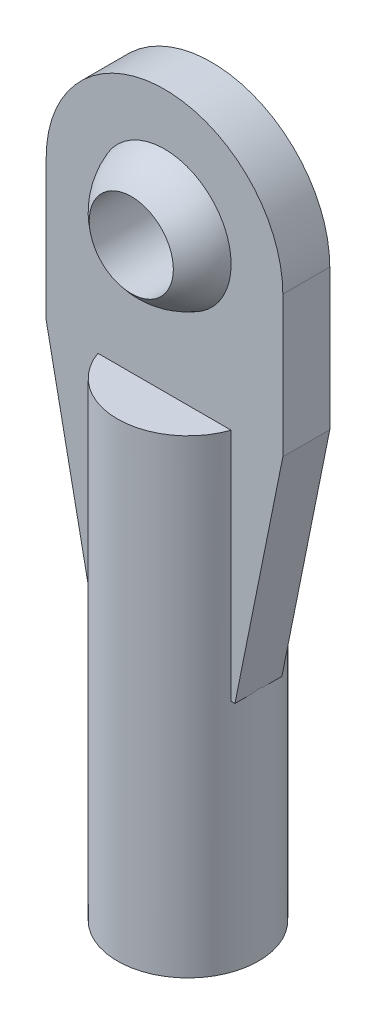
ISO-10303-21;
HEADER;
FILE_DESCRIPTION(('STEP AP214'),'2;1');
FILE_NAME('part.step','',(''),(''),'','','');
FILE_SCHEMA(('AUTOMOTIVE_DESIGN { 1 0 10303 214 1 1 1 1 }'));
ENDSEC;
DATA;
#1=APPLICATION_CONTEXT('core data for automotive mechanical design processes');
#2=APPLICATION_PROTOCOL_DEFINITION('international standard','automotive_design',2000,#1);
#3=PRODUCT_CONTEXT('',#1,'mechanical');
#4=PRODUCT('Part','Part','',(#3));
#5=PRODUCT_RELATED_PRODUCT_CATEGORY('part','',(#4));
#6=PRODUCT_DEFINITION_FORMATION('','',#4);
#7=PRODUCT_DEFINITION_CONTEXT('part definition',#1,'design');
#8=PRODUCT_DEFINITION('design','',#6,#7);
#9=PRODUCT_DEFINITION_SHAPE('','',#8);
#10=(LENGTH_UNIT() NAMED_UNIT(*) SI_UNIT(.MILLI.,.METRE.));
#11=(NAMED_UNIT(*) PLANE_ANGLE_UNIT() SI_UNIT($,.RADIAN.));
#12=(NAMED_UNIT(*) SI_UNIT($,.STERADIAN.) SOLID_ANGLE_UNIT());
#13=UNCERTAINTY_MEASURE_WITH_UNIT(LENGTH_MEASURE(1.E-05),#10,'distance_accuracy_value','');
#14=(GEOMETRIC_REPRESENTATION_CONTEXT(3) GLOBAL_UNCERTAINTY_ASSIGNED_CONTEXT((#13)) GLOBAL_UNIT_ASSIGNED_CONTEXT((#10,
#11,#12)) REPRESENTATION_CONTEXT('',''));
#15=CARTESIAN_POINT('',(0.,0.,0.));
#16=DIRECTION('',(0.,0.,1.));
#17=DIRECTION('',(1.,0.,0.));
#18=AXIS2_PLACEMENT_3D('',#15,#16,#17);
#19=CARTESIAN_POINT('',(-2.38125,-12.79525,0.79375));
#20=DIRECTION('',(0.,1.,0.));
#21=DIRECTION('',(0.,0.,1.));
#22=AXIS2_PLACEMENT_3D('',#19,#20,#21);
#23=PLANE('',#22);
#24=DIRECTION('',(1.,0.,0.));
#25=VECTOR('',#24,1.);
#26=CARTESIAN_POINT('',(-2.38125,-12.79525,0.79375));
#27=LINE('',#26,#25);
#28=CARTESIAN_POINT('',(2.25179810318332,-12.79525,0.79375));
#29=VERTEX_POINT('',#28);
#30=CARTESIAN_POINT('',(2.38125,-12.79525,0.79375));
#31=VERTEX_POINT('',#30);
#32=EDGE_CURVE('E93',#29,#31,#27,.T.);
#33=ORIENTED_EDGE('',*,*,#32,.F.);
#34=CARTESIAN_POINT('',(0.,-12.79525,0.));
#35=DIRECTION('',(0.,1.,0.));
#36=DIRECTION('',(0.,0.,1.));
#37=AXIS2_PLACEMENT_3D('',#34,#35,#36);
#38=CIRCLE('',#37,2.3876);
#39=CARTESIAN_POINT('',(2.38125,-12.79525,0.174017807996744));
#40=VERTEX_POINT('',#39);
#41=EDGE_CURVE('E190',#29,#40,#38,.T.);
#42=ORIENTED_EDGE('',*,*,#41,.T.);
#43=DIRECTION('',(0.,0.,-1.));
#44=VECTOR('',#43,1.);
#45=CARTESIAN_POINT('',(2.38125,-12.79525,0.79375));
#46=LINE('',#45,#44);
#47=EDGE_CURVE('E154',#31,#40,#46,.T.);
#48=ORIENTED_EDGE('',*,*,#47,.F.);
#49=EDGE_LOOP('',(#33,#42,#48));
#50=FACE_BOUND('',#49,.T.);
#51=ADVANCED_FACE('F33',(#50),#23,.F.);
#52=CARTESIAN_POINT('',(2.38125,-12.79525,-0.174017807996744));
#53=VERTEX_POINT('',#52);
#54=CARTESIAN_POINT('',(2.38125,-12.79525,-0.79375));
#55=VERTEX_POINT('',#54);
#56=EDGE_CURVE('E153',#53,#55,#46,.T.);
#57=ORIENTED_EDGE('',*,*,#56,.F.);
#58=CARTESIAN_POINT('',(2.25179810318332,-12.79525,-0.79375));
#59=VERTEX_POINT('',#58);
#60=EDGE_CURVE('E194',#53,#59,#38,.T.);
#61=ORIENTED_EDGE('',*,*,#60,.T.);
#62=DIRECTION('',(1.,0.,0.));
#63=VECTOR('',#62,1.);
#64=CARTESIAN_POINT('',(-2.38125,-12.79525,-0.79375));
#65=LINE('',#64,#63);
#66=EDGE_CURVE('E136',#59,#55,#65,.T.);
#67=ORIENTED_EDGE('',*,*,#66,.T.);
#68=EDGE_LOOP('',(#57,#61,#67));
#69=FACE_BOUND('',#68,.T.);
#70=ADVANCED_FACE('F240',(#69),#23,.F.);
#71=CARTESIAN_POINT('',(-2.38125,-12.79525,-0.79375));
#72=VERTEX_POINT('',#71);
#73=CARTESIAN_POINT('',(-2.25179810318332,-12.79525,-0.79375));
#74=VERTEX_POINT('',#73);
#75=EDGE_CURVE('E133',#72,#74,#65,.T.);
#76=ORIENTED_EDGE('',*,*,#75,.T.);
#77=CARTESIAN_POINT('',(-2.38125,-12.79525,-0.174017807996779));
#78=VERTEX_POINT('',#77);
#79=EDGE_CURVE('E200',#74,#78,#38,.T.);
#80=ORIENTED_EDGE('',*,*,#79,.T.);
#81=DIRECTION('',(0.,0.,-1.));
#82=VECTOR('',#81,1.);
#83=CARTESIAN_POINT('',(-2.38125,-12.79525,0.79375));
#84=LINE('',#83,#82);
#85=EDGE_CURVE('E85',#78,#72,#84,.T.);
#86=ORIENTED_EDGE('',*,*,#85,.T.);
#87=EDGE_LOOP('',(#76,#80,#86));
#88=FACE_BOUND('',#87,.T.);
#89=ADVANCED_FACE('F246',(#88),#23,.F.);
#90=CARTESIAN_POINT('',(0.,0.,0.));
#91=DIRECTION('',(0.,1.,0.));
#92=DIRECTION('',(1.,0.,0.));
#93=AXIS2_PLACEMENT_3D('',#90,#91,#92);
#94=SPHERICAL_SURFACE('',#93,2.3876);
#95=CARTESIAN_POINT('',(0.,0.,0.));
#96=DIRECTION('',(0.,0.,1.));
#97=DIRECTION('',(1.,0.,0.));
#98=AXIS2_PLACEMENT_3D('',#95,#96,#97);
#99=SPHERICAL_SURFACE('',#98,2.3876);
#100=CARTESIAN_POINT('',(0.,0.,-1.91765794655877));
#101=DIRECTION('',(0.,0.,1.));
#102=DIRECTION('',(1.,0.,0.));
#103=AXIS2_PLACEMENT_3D('',#100,#101,#102);
#104=CIRCLE('',#103,1.4224);
#105=CARTESIAN_POINT('',(1.4224,0.,-1.91765794655877));
#106=VERTEX_POINT('',#105);
#107=EDGE_CURVE('E164',#106,#106,#104,.T.);
#108=ORIENTED_EDGE('',*,*,#107,.T.);
#109=EDGE_LOOP('',(#108));
#110=FACE_BOUND('',#109,.T.);
#111=CARTESIAN_POINT('',(0.,0.,-0.79375));
#112=DIRECTION('',(0.,0.,1.));
#113=DIRECTION('',(1.,0.,0.));
#114=AXIS2_PLACEMENT_3D('',#111,#112,#113);
#115=CIRCLE('',#114,2.25179810318332);
#116=CARTESIAN_POINT('',(2.25179810318332,0.,-0.79375));
#117=VERTEX_POINT('',#116);
#118=EDGE_CURVE('E158',#117,#117,#115,.T.);
#119=ORIENTED_EDGE('',*,*,#118,.F.);
#120=EDGE_LOOP('',(#119));
#121=FACE_BOUND('',#120,.T.);
#122=ADVANCED_FACE('F261',(#110,#121),#99,.T.);
#123=CARTESIAN_POINT('',(0.,0.,0.));
#124=DIRECTION('',(0.,0.,1.));
#125=DIRECTION('',(1.,0.,0.));
#126=AXIS2_PLACEMENT_3D('',#123,#124,#125);
#127=SPHERICAL_SURFACE('',#126,2.3876);
#128=CARTESIAN_POINT('',(0.,0.,0.79375));
#129=DIRECTION('',(0.,0.,1.));
#130=DIRECTION('',(1.,0.,0.));
#131=AXIS2_PLACEMENT_3D('',#128,#129,#130);
#132=CIRCLE('',#131,2.25179810318332);
#133=CARTESIAN_POINT('',(2.25179810318332,0.,0.79375));
#134=VERTEX_POINT('',#133);
#135=EDGE_CURVE('E157',#134,#134,#132,.T.);
#136=ORIENTED_EDGE('',*,*,#135,.T.);
#137=EDGE_LOOP('',(#136));
#138=FACE_BOUND('',#137,.T.);
#139=CARTESIAN_POINT('',(0.,0.,1.91765794655877));
#140=DIRECTION('',(0.,0.,-1.));
#141=DIRECTION('',(-1.,0.,0.));
#142=AXIS2_PLACEMENT_3D('',#139,#140,#141);
#143=CIRCLE('',#142,1.4224);
#144=CARTESIAN_POINT('',(-1.4224,0.,1.91765794655877));
#145=VERTEX_POINT('',#144);
#146=EDGE_CURVE('E161',#145,#145,#143,.T.);
#147=ORIENTED_EDGE('',*,*,#146,.T.);
#148=EDGE_LOOP('',(#147));
#149=FACE_BOUND('',#148,.T.);
#150=ADVANCED_FACE('F35',(#138,#149),#127,.T.);
#151=CARTESIAN_POINT('',(0.,0.,-2.3876));
#152=DIRECTION('',(0.,0.,1.));
#153=DIRECTION('',(1.,0.,0.));
#154=AXIS2_PLACEMENT_3D('',#151,#152,#153);
#155=CYLINDRICAL_SURFACE('',#154,1.4224);
#156=ORIENTED_EDGE('',*,*,#146,.F.);
#157=EDGE_LOOP('',(#156));
#158=FACE_BOUND('',#157,.T.);
#159=ORIENTED_EDGE('',*,*,#107,.F.);
#160=EDGE_LOOP('',(#159));
#161=FACE_BOUND('',#160,.T.);
#162=ADVANCED_FACE('F319',(#158,#161),#155,.F.);
#163=CARTESIAN_POINT('',(0.,0.,0.79375));
#164=DIRECTION('',(0.,0.,1.));
#165=DIRECTION('',(1.,0.,0.));
#166=AXIS2_PLACEMENT_3D('',#163,#164,#165);
#167=PLANE('',#166);
#168=DIRECTION('',(0.,-1.,0.));
#169=VECTOR('',#168,1.);
#170=CARTESIAN_POINT('',(-2.25179810318332,-4.85775,0.79375));
#171=LINE('',#170,#169);
#172=CARTESIAN_POINT('',(-2.25179810318332,-4.85775,0.79375));
#173=VERTEX_POINT('',#172);
#174=CARTESIAN_POINT('',(-2.25179810318332,-12.79525,0.79375));
#175=VERTEX_POINT('',#174);
#176=EDGE_CURVE('E195',#173,#175,#171,.T.);
#177=ORIENTED_EDGE('',*,*,#176,.F.);
#178=DIRECTION('',(1.,0.,0.));
#179=VECTOR('',#178,1.);
#180=CARTESIAN_POINT('',(0.,-4.85775,0.79375));
#181=LINE('',#180,#179);
#182=CARTESIAN_POINT('',(2.25179810318332,-4.85775,0.79375));
#183=VERTEX_POINT('',#182);
#184=EDGE_CURVE('E181',#173,#183,#181,.T.);
#185=ORIENTED_EDGE('',*,*,#184,.T.);
#186=DIRECTION('',(0.,-1.,0.));
#187=VECTOR('',#186,1.);
#188=CARTESIAN_POINT('',(2.25179810318332,-4.85775,0.79375));
#189=LINE('',#188,#187);
#190=EDGE_CURVE('E184',#29,#183,#189,.F.);
#191=ORIENTED_EDGE('',*,*,#190,.F.);
#192=ORIENTED_EDGE('',*,*,#32,.T.);
#193=DIRECTION('',(0.1976061511247,0.980281494795083,0.));
#194=VECTOR('',#193,1.);
#195=CARTESIAN_POINT('',(4.0005,-4.7625,0.79375));
#196=LINE('',#195,#194);
#197=CARTESIAN_POINT('',(4.0005,-4.7625,0.79375));
#198=VERTEX_POINT('',#197);
#199=EDGE_CURVE('E177',#31,#198,#196,.T.);
#200=ORIENTED_EDGE('',*,*,#199,.T.);
#201=DIRECTION('',(0.,1.,0.));
#202=VECTOR('',#201,1.);
#203=CARTESIAN_POINT('',(4.0005,0.,0.79375));
#204=LINE('',#203,#202);
#205=CARTESIAN_POINT('',(4.0005,0.,0.79375));
#206=VERTEX_POINT('',#205);
#207=EDGE_CURVE('E112',#198,#206,#204,.T.);
#208=ORIENTED_EDGE('',*,*,#207,.T.);
#209=CARTESIAN_POINT('',(0.,0.,0.79375));
#210=DIRECTION('',(0.,0.,1.));
#211=DIRECTION('',(1.,0.,0.));
#212=AXIS2_PLACEMENT_3D('',#209,#210,#211);
#213=CIRCLE('',#212,4.0005);
#214=CARTESIAN_POINT('',(-4.0005,0.,0.79375));
#215=VERTEX_POINT('',#214);
#216=EDGE_CURVE('E103',#206,#215,#213,.T.);
#217=ORIENTED_EDGE('',*,*,#216,.T.);
#218=DIRECTION('',(0.,-1.,0.));
#219=VECTOR('',#218,1.);
#220=CARTESIAN_POINT('',(-4.0005,0.,0.79375));
#221=LINE('',#220,#219);
#222=CARTESIAN_POINT('',(-4.0005,-4.7625,0.79375));
#223=VERTEX_POINT('',#222);
#224=EDGE_CURVE('E109',#215,#223,#221,.T.);
#225=ORIENTED_EDGE('',*,*,#224,.T.);
#226=DIRECTION('',(0.1976061511247,-0.980281494795083,0.));
#227=VECTOR('',#226,1.);
#228=CARTESIAN_POINT('',(-4.0005,-4.7625,0.79375));
#229=LINE('',#228,#227);
#230=CARTESIAN_POINT('',(-2.38125,-12.79525,0.79375));
#231=VERTEX_POINT('',#230);
#232=EDGE_CURVE('E57',#223,#231,#229,.T.);
#233=ORIENTED_EDGE('',*,*,#232,.T.);
#234=EDGE_CURVE('E176',#231,#175,#27,.T.);
#235=ORIENTED_EDGE('',*,*,#234,.T.);
#236=EDGE_LOOP('',(#177,#185,#191,#192,#200,#208,#217,#225,#233,#235));
#237=FACE_BOUND('',#236,.T.);
#238=ORIENTED_EDGE('',*,*,#135,.F.);
#239=EDGE_LOOP('',(#238));
#240=FACE_BOUND('',#239,.T.);
#241=ADVANCED_FACE('F106',(#237,#240),#167,.T.);
#242=CARTESIAN_POINT('',(0.,0.,-0.79375));
#243=DIRECTION('',(0.,0.,1.));
#244=DIRECTION('',(1.,0.,0.));
#245=AXIS2_PLACEMENT_3D('',#242,#243,#244);
#246=PLANE('',#245);
#247=DIRECTION('',(1.,0.,0.));
#248=VECTOR('',#247,1.);
#249=CARTESIAN_POINT('',(0.,-4.85775,-0.79375));
#250=LINE('',#249,#248);
#251=CARTESIAN_POINT('',(-2.25179810318332,-4.85775,-0.79375));
#252=VERTEX_POINT('',#251);
#253=CARTESIAN_POINT('',(2.25179810318332,-4.85775,-0.79375));
#254=VERTEX_POINT('',#253);
#255=EDGE_CURVE('E11',#252,#254,#250,.T.);
#256=ORIENTED_EDGE('',*,*,#255,.F.);
#257=DIRECTION('',(0.,-1.,0.));
#258=VECTOR('',#257,1.);
#259=CARTESIAN_POINT('',(-2.25179810318332,-4.85775,-0.79375));
#260=LINE('',#259,#258);
#261=EDGE_CURVE('E197',#252,#74,#260,.T.);
#262=ORIENTED_EDGE('',*,*,#261,.T.);
#263=ORIENTED_EDGE('',*,*,#75,.F.);
#264=DIRECTION('',(0.1976061511247,-0.980281494795083,0.));
#265=VECTOR('',#264,1.);
#266=CARTESIAN_POINT('',(-4.0005,-4.7625,-0.79375));
#267=LINE('',#266,#265);
#268=CARTESIAN_POINT('',(-4.0005,-4.7625,-0.79375));
#269=VERTEX_POINT('',#268);
#270=EDGE_CURVE('E143',#269,#72,#267,.T.);
#271=ORIENTED_EDGE('',*,*,#270,.F.);
#272=DIRECTION('',(0.,-1.,0.));
#273=VECTOR('',#272,1.);
#274=CARTESIAN_POINT('',(-4.0005,0.,-0.79375));
#275=LINE('',#274,#273);
#276=CARTESIAN_POINT('',(-4.0005,0.,-0.79375));
#277=VERTEX_POINT('',#276);
#278=EDGE_CURVE('E141',#277,#269,#275,.T.);
#279=ORIENTED_EDGE('',*,*,#278,.F.);
#280=CARTESIAN_POINT('',(0.,0.,-0.79375));
#281=DIRECTION('',(0.,0.,1.));
#282=DIRECTION('',(1.,0.,0.));
#283=AXIS2_PLACEMENT_3D('',#280,#281,#282);
#284=CIRCLE('',#283,4.0005);
#285=CARTESIAN_POINT('',(4.0005,0.,-0.79375));
#286=VERTEX_POINT('',#285);
#287=EDGE_CURVE('E121',#286,#277,#284,.T.);
#288=ORIENTED_EDGE('',*,*,#287,.F.);
#289=DIRECTION('',(0.,1.,0.));
#290=VECTOR('',#289,1.);
#291=CARTESIAN_POINT('',(4.0005,0.,-0.79375));
#292=LINE('',#291,#290);
#293=CARTESIAN_POINT('',(4.0005,-4.7625,-0.79375));
#294=VERTEX_POINT('',#293);
#295=EDGE_CURVE('E138',#294,#286,#292,.T.);
#296=ORIENTED_EDGE('',*,*,#295,.F.);
#297=DIRECTION('',(0.1976061511247,0.980281494795083,0.));
#298=VECTOR('',#297,1.);
#299=CARTESIAN_POINT('',(4.0005,-4.7625,-0.79375));
#300=LINE('',#299,#298);
#301=EDGE_CURVE('E135',#55,#294,#300,.T.);
#302=ORIENTED_EDGE('',*,*,#301,.F.);
#303=ORIENTED_EDGE('',*,*,#66,.F.);
#304=DIRECTION('',(0.,-1.,0.));
#305=VECTOR('',#304,1.);
#306=CARTESIAN_POINT('',(2.25179810318332,-4.85775,-0.79375));
#307=LINE('',#306,#305);
#308=EDGE_CURVE('E187',#59,#254,#307,.F.);
#309=ORIENTED_EDGE('',*,*,#308,.T.);
#310=EDGE_LOOP('',(#256,#262,#263,#271,#279,#288,#296,#302,#303,#309));
#311=FACE_BOUND('',#310,.T.);
#312=ORIENTED_EDGE('',*,*,#118,.T.);
#313=EDGE_LOOP('',(#312));
#314=FACE_BOUND('',#313,.T.);
#315=ADVANCED_FACE('F251',(#311,#314),#246,.F.);
#316=CARTESIAN_POINT('',(-2.38125,-12.79525,0.174017807996779));
#317=VERTEX_POINT('',#316);
#318=EDGE_CURVE('E145',#231,#317,#84,.T.);
#319=ORIENTED_EDGE('',*,*,#318,.T.);
#320=EDGE_CURVE('E48',#317,#175,#38,.T.);
#321=ORIENTED_EDGE('',*,*,#320,.T.);
#322=ORIENTED_EDGE('',*,*,#234,.F.);
#323=EDGE_LOOP('',(#319,#321,#322));
#324=FACE_BOUND('',#323,.T.);
#325=ADVANCED_FACE('F174',(#324),#23,.F.);
#326=CARTESIAN_POINT('',(4.0005,-4.7625,0.79375));
#327=DIRECTION('',(-0.980281494795083,0.1976061511247,0.));
#328=DIRECTION('',(-0.1976061511247,-0.980281494795083,0.));
#329=AXIS2_PLACEMENT_3D('',#326,#327,#328);
#330=PLANE('',#329);
#331=ORIENTED_EDGE('',*,*,#47,.T.);
#332=CARTESIAN_POINT('',(0.,-24.6081176470589,0.));
#333=DIRECTION('',(-0.980281494795083,0.1976061511247,0.));
#334=DIRECTION('',(-0.1976061511247,-0.980281494795083,0.));
#335=AXIS2_PLACEMENT_3D('',#332,#333,#334);
#336=ELLIPSE('',#335,12.082619829447,2.3876);
#337=EDGE_CURVE('E191',#40,#53,#336,.T.);
#338=ORIENTED_EDGE('',*,*,#337,.T.);
#339=ORIENTED_EDGE('',*,*,#56,.T.);
#340=ORIENTED_EDGE('',*,*,#301,.T.);
#341=DIRECTION('',(0.,0.,-1.));
#342=VECTOR('',#341,1.);
#343=CARTESIAN_POINT('',(4.0005,-4.7625,0.79375));
#344=LINE('',#343,#342);
#345=EDGE_CURVE('E150',#198,#294,#344,.T.);
#346=ORIENTED_EDGE('',*,*,#345,.F.);
#347=ORIENTED_EDGE('',*,*,#199,.F.);
#348=EDGE_LOOP('',(#331,#338,#339,#340,#346,#347));
#349=FACE_BOUND('',#348,.T.);
#350=ADVANCED_FACE('F250',(#349),#330,.F.);
#351=CARTESIAN_POINT('',(4.0005,0.,0.79375));
#352=DIRECTION('',(-1.,0.,0.));
#353=DIRECTION('',(0.,-1.,0.));
#354=AXIS2_PLACEMENT_3D('',#351,#352,#353);
#355=PLANE('',#354);
#356=ORIENTED_EDGE('',*,*,#295,.T.);
#357=DIRECTION('',(0.,0.,-1.));
#358=VECTOR('',#357,1.);
#359=CARTESIAN_POINT('',(4.0005,0.,0.79375));
#360=LINE('',#359,#358);
#361=EDGE_CURVE('E124',#206,#286,#360,.T.);
#362=ORIENTED_EDGE('',*,*,#361,.F.);
#363=ORIENTED_EDGE('',*,*,#207,.F.);
#364=ORIENTED_EDGE('',*,*,#345,.T.);
#365=EDGE_LOOP('',(#356,#362,#363,#364));
#366=FACE_BOUND('',#365,.T.);
#367=ADVANCED_FACE('F256',(#366),#355,.F.);
#368=CARTESIAN_POINT('',(0.,0.,0.79375));
#369=DIRECTION('',(0.,0.,-1.));
#370=DIRECTION('',(-1.,0.,0.));
#371=AXIS2_PLACEMENT_3D('',#368,#369,#370);
#372=CYLINDRICAL_SURFACE('',#371,4.0005);
#373=ORIENTED_EDGE('',*,*,#287,.T.);
#374=DIRECTION('',(0.,0.,-1.));
#375=VECTOR('',#374,1.);
#376=CARTESIAN_POINT('',(-4.0005,0.,0.79375));
#377=LINE('',#376,#375);
#378=EDGE_CURVE('E118',#215,#277,#377,.T.);
#379=ORIENTED_EDGE('',*,*,#378,.F.);
#380=ORIENTED_EDGE('',*,*,#216,.F.);
#381=ORIENTED_EDGE('',*,*,#361,.T.);
#382=EDGE_LOOP('',(#373,#379,#380,#381));
#383=FACE_BOUND('',#382,.T.);
#384=ADVANCED_FACE('F119',(#383),#372,.T.);
#385=CARTESIAN_POINT('',(-4.0005,0.,0.79375));
#386=DIRECTION('',(1.,0.,0.));
#387=DIRECTION('',(0.,1.,0.));
#388=AXIS2_PLACEMENT_3D('',#385,#386,#387);
#389=PLANE('',#388);
#390=ORIENTED_EDGE('',*,*,#278,.T.);
#391=DIRECTION('',(0.,0.,-1.));
#392=VECTOR('',#391,1.);
#393=CARTESIAN_POINT('',(-4.0005,-4.7625,0.79375));
#394=LINE('',#393,#392);
#395=EDGE_CURVE('E125',#223,#269,#394,.T.);
#396=ORIENTED_EDGE('',*,*,#395,.F.);
#397=ORIENTED_EDGE('',*,*,#224,.F.);
#398=ORIENTED_EDGE('',*,*,#378,.T.);
#399=EDGE_LOOP('',(#390,#396,#397,#398));
#400=FACE_BOUND('',#399,.T.);
#401=ADVANCED_FACE('F127',(#400),#389,.F.);
#402=CARTESIAN_POINT('',(-4.0005,-4.7625,0.79375));
#403=DIRECTION('',(0.980281494795083,0.1976061511247,0.));
#404=DIRECTION('',(-0.1976061511247,0.980281494795083,0.));
#405=AXIS2_PLACEMENT_3D('',#402,#403,#404);
#406=PLANE('',#405);
#407=ORIENTED_EDGE('',*,*,#85,.F.);
#408=CARTESIAN_POINT('',(0.,-24.6081176470588,0.));
#409=DIRECTION('',(0.980281494795083,0.1976061511247,0.));
#410=DIRECTION('',(0.1976061511247,-0.980281494795083,0.));
#411=AXIS2_PLACEMENT_3D('',#408,#409,#410);
#412=ELLIPSE('',#411,12.082619829447,2.3876);
#413=EDGE_CURVE('E41',#78,#317,#412,.T.);
#414=ORIENTED_EDGE('',*,*,#413,.T.);
#415=ORIENTED_EDGE('',*,*,#318,.F.);
#416=ORIENTED_EDGE('',*,*,#232,.F.);
#417=ORIENTED_EDGE('',*,*,#395,.T.);
#418=ORIENTED_EDGE('',*,*,#270,.T.);
#419=EDGE_LOOP('',(#407,#414,#415,#416,#417,#418));
#420=FACE_BOUND('',#419,.T.);
#421=ADVANCED_FACE('F169',(#420),#406,.F.);
#422=CARTESIAN_POINT('',(0.,-4.85775,0.));
#423=DIRECTION('',(0.,-1.,0.));
#424=DIRECTION('',(0.,0.,-1.));
#425=AXIS2_PLACEMENT_3D('',#422,#423,#424);
#426=PLANE('',#425);
#427=CARTESIAN_POINT('',(0.,-4.85775,0.));
#428=DIRECTION('',(0.,-1.,0.));
#429=DIRECTION('',(0.,0.,-1.));
#430=AXIS2_PLACEMENT_3D('',#427,#428,#429);
#431=CIRCLE('',#430,2.3876);
#432=EDGE_CURVE('E206',#252,#254,#431,.T.);
#433=ORIENTED_EDGE('',*,*,#432,.F.);
#434=ORIENTED_EDGE('',*,*,#255,.T.);
#435=EDGE_LOOP('',(#433,#434));
#436=FACE_BOUND('',#435,.T.);
#437=ADVANCED_FACE('F228',(#436),#426,.F.);
#438=CARTESIAN_POINT('',(0.,-4.85775,0.));
#439=DIRECTION('',(0.,-1.,0.));
#440=DIRECTION('',(0.,0.,-1.));
#441=AXIS2_PLACEMENT_3D('',#438,#439,#440);
#442=CYLINDRICAL_SURFACE('',#441,2.3876);
#443=ORIENTED_EDGE('',*,*,#41,.F.);
#444=ORIENTED_EDGE('',*,*,#190,.T.);
#445=EDGE_CURVE('E202',#183,#173,#431,.T.);
#446=ORIENTED_EDGE('',*,*,#445,.T.);
#447=ORIENTED_EDGE('',*,*,#176,.T.);
#448=ORIENTED_EDGE('',*,*,#320,.F.);
#449=ORIENTED_EDGE('',*,*,#413,.F.);
#450=ORIENTED_EDGE('',*,*,#79,.F.);
#451=ORIENTED_EDGE('',*,*,#261,.F.);
#452=ORIENTED_EDGE('',*,*,#432,.T.);
#453=ORIENTED_EDGE('',*,*,#308,.F.);
#454=ORIENTED_EDGE('',*,*,#60,.F.);
#455=ORIENTED_EDGE('',*,*,#337,.F.);
#456=EDGE_LOOP('',(#443,#444,#446,#447,#448,#449,#450,#451,#452,#453,#454,#455));
#457=FACE_BOUND('',#456,.T.);
#458=CARTESIAN_POINT('',(0.,-20.73275,0.));
#459=DIRECTION('',(0.,-1.,0.));
#460=DIRECTION('',(0.,0.,-1.));
#461=AXIS2_PLACEMENT_3D('',#458,#459,#460);
#462=CIRCLE('',#461,2.3876);
#463=CARTESIAN_POINT('',(0.,-20.73275,-2.3876));
#464=VERTEX_POINT('',#463);
#465=EDGE_CURVE('E203',#464,#464,#462,.T.);
#466=ORIENTED_EDGE('',*,*,#465,.F.);
#467=EDGE_LOOP('',(#466));
#468=FACE_BOUND('',#467,.T.);
#469=ADVANCED_FACE('F226',(#457,#468),#442,.T.);
#470=ORIENTED_EDGE('',*,*,#184,.F.);
#471=ORIENTED_EDGE('',*,*,#445,.F.);
#472=EDGE_LOOP('',(#470,#471));
#473=FACE_BOUND('',#472,.T.);
#474=ADVANCED_FACE('F222',(#473),#426,.F.);
#475=CARTESIAN_POINT('',(0.,-20.73275,0.));
#476=DIRECTION('',(0.,-1.,0.));
#477=DIRECTION('',(0.,0.,-1.));
#478=AXIS2_PLACEMENT_3D('',#475,#476,#477);
#479=PLANE('',#478);
#480=CARTESIAN_POINT('',(0.,-20.73275,0.));
#481=DIRECTION('',(0.,-1.,0.));
#482=DIRECTION('',(0.,0.,-1.));
#483=AXIS2_PLACEMENT_3D('',#480,#481,#482);
#484=CIRCLE('',#483,1.13029999999999);
#485=CARTESIAN_POINT('',(0.,-20.73275,-1.13029999999999));
#486=VERTEX_POINT('',#485);
#487=EDGE_CURVE('E212',#486,#486,#484,.T.);
#488=ORIENTED_EDGE('',*,*,#487,.F.);
#489=EDGE_LOOP('',(#488));
#490=FACE_BOUND('',#489,.T.);
#491=ORIENTED_EDGE('',*,*,#465,.T.);
#492=EDGE_LOOP('',(#491));
#493=FACE_BOUND('',#492,.T.);
#494=ADVANCED_FACE('F218',(#490,#493),#479,.T.);
#495=CARTESIAN_POINT('',(0.,-8.03275,0.));
#496=DIRECTION('',(0.,-1.,0.));
#497=DIRECTION('',(0.,0.,-1.));
#498=AXIS2_PLACEMENT_3D('',#495,#496,#497);
#499=CONICAL_SURFACE('',#498,1.1303,1.02974425867665);
#500=CARTESIAN_POINT('',(0.,-7.35359724231315,0.));
#501=VERTEX_POINT('',#500);
#502=VERTEX_LOOP('',#501);
#503=FACE_BOUND('',#502,.T.);
#504=CARTESIAN_POINT('',(0.,-8.03275,0.));
#505=DIRECTION('',(0.,-1.,0.));
#506=DIRECTION('',(0.,0.,-1.));
#507=AXIS2_PLACEMENT_3D('',#504,#505,#506);
#508=CIRCLE('',#507,1.1303);
#509=CARTESIAN_POINT('',(0.,-8.03275,-1.1303));
#510=VERTEX_POINT('',#509);
#511=EDGE_CURVE('E207',#510,#510,#508,.T.);
#512=ORIENTED_EDGE('',*,*,#511,.T.);
#513=EDGE_LOOP('',(#512));
#514=FACE_BOUND('',#513,.T.);
#515=ADVANCED_FACE('F221',(#503,#514),#499,.F.);
#516=CARTESIAN_POINT('',(0.,-20.73275,0.));
#517=DIRECTION('',(0.,-1.,0.));
#518=DIRECTION('',(0.,0.,-1.));
#519=AXIS2_PLACEMENT_3D('',#516,#517,#518);
#520=CYLINDRICAL_SURFACE('',#519,1.13029999999999);
#521=ORIENTED_EDGE('',*,*,#511,.F.);
#522=EDGE_LOOP('',(#521));
#523=FACE_BOUND('',#522,.T.);
#524=ORIENTED_EDGE('',*,*,#487,.T.);
#525=EDGE_LOOP('',(#524));
#526=FACE_BOUND('',#525,.T.);
#527=ADVANCED_FACE('F216',(#523,#526),#520,.F.);
#528=CLOSED_SHELL('',(#51,#70,#89,#122,#150,#162,#241,#315,#325,#350,#367,#384,#401,#421,#437,
#469,#474,#494,#515,#527));
#529=MANIFOLD_SOLID_BREP('B2',#528);
#530=ADVANCED_BREP_SHAPE_REPRESENTATION('',(#18,#529),#14);
#531=SHAPE_DEFINITION_REPRESENTATION(#9,#530);
ENDSEC;
END-ISO-10303-21;
